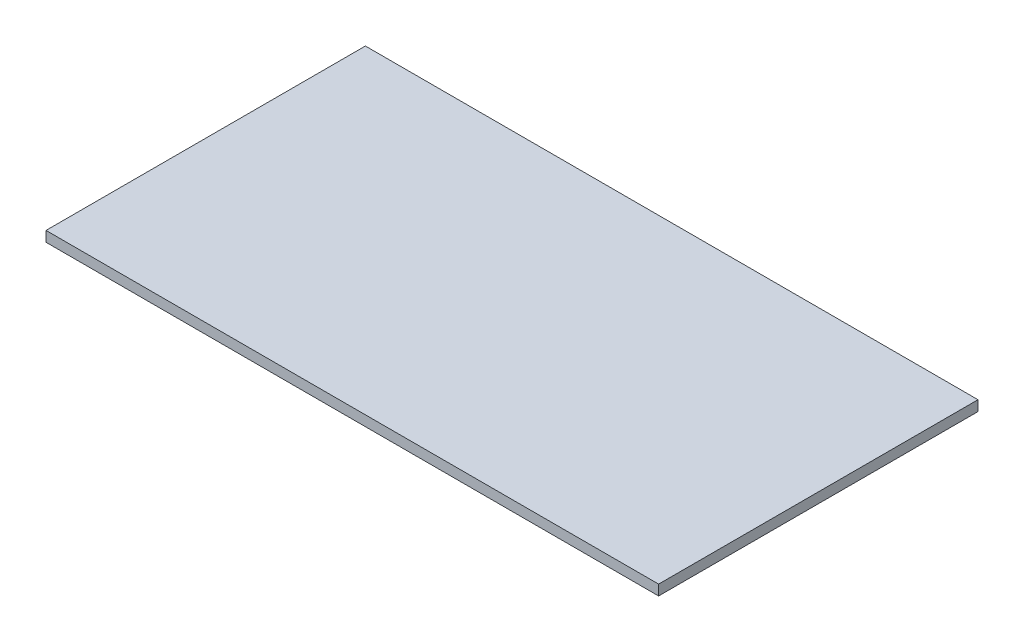
ISO-10303-21;
HEADER;
FILE_DESCRIPTION(('STEP AP214'),'2;1');
FILE_NAME('part.step','',(''),(''),'','','');
FILE_SCHEMA(('AUTOMOTIVE_DESIGN { 1 0 10303 214 1 1 1 1 }'));
ENDSEC;
DATA;
#1=APPLICATION_CONTEXT('core data for automotive mechanical design processes');
#2=APPLICATION_PROTOCOL_DEFINITION('international standard','automotive_design',2000,#1);
#3=PRODUCT_CONTEXT('',#1,'mechanical');
#4=PRODUCT('Part','Part','',(#3));
#5=PRODUCT_RELATED_PRODUCT_CATEGORY('part','',(#4));
#6=PRODUCT_DEFINITION_FORMATION('','',#4);
#7=PRODUCT_DEFINITION_CONTEXT('part definition',#1,'design');
#8=PRODUCT_DEFINITION('design','',#6,#7);
#9=PRODUCT_DEFINITION_SHAPE('','',#8);
#10=(LENGTH_UNIT() NAMED_UNIT(*) SI_UNIT(.MILLI.,.METRE.));
#11=(NAMED_UNIT(*) PLANE_ANGLE_UNIT() SI_UNIT($,.RADIAN.));
#12=(NAMED_UNIT(*) SI_UNIT($,.STERADIAN.) SOLID_ANGLE_UNIT());
#13=UNCERTAINTY_MEASURE_WITH_UNIT(LENGTH_MEASURE(1.E-05),#10,'distance_accuracy_value','');
#14=(GEOMETRIC_REPRESENTATION_CONTEXT(3) GLOBAL_UNCERTAINTY_ASSIGNED_CONTEXT((#13)) GLOBAL_UNIT_ASSIGNED_CONTEXT((#10,
#11,#12)) REPRESENTATION_CONTEXT('',''));
#15=CARTESIAN_POINT('',(0.,0.,0.));
#16=DIRECTION('',(0.,0.,1.));
#17=DIRECTION('',(1.,0.,0.));
#18=AXIS2_PLACEMENT_3D('',#15,#16,#17);
#19=CARTESIAN_POINT('',(63.,0.,31.02));
#20=DIRECTION('',(0.,0.,-1.));
#21=DIRECTION('',(-1.,0.,0.));
#22=AXIS2_PLACEMENT_3D('',#19,#20,#21);
#23=PLANE('',#22);
#24=DIRECTION('',(0.,1.,0.));
#25=VECTOR('',#24,1.);
#26=CARTESIAN_POINT('',(-56.,-8.,31.02));
#27=LINE('',#26,#25);
#28=CARTESIAN_POINT('',(-56.,0.,31.02));
#29=VERTEX_POINT('',#28);
#30=CARTESIAN_POINT('',(-56.,2.,31.02));
#31=VERTEX_POINT('',#30);
#32=EDGE_CURVE('E83',#29,#31,#27,.T.);
#33=ORIENTED_EDGE('',*,*,#32,.F.);
#34=DIRECTION('',(-1.,0.,0.));
#35=VECTOR('',#34,1.);
#36=CARTESIAN_POINT('',(0.,0.,31.02));
#37=LINE('',#36,#35);
#38=CARTESIAN_POINT('',(63.,0.,31.02));
#39=VERTEX_POINT('',#38);
#40=EDGE_CURVE('E92',#39,#29,#37,.T.);
#41=ORIENTED_EDGE('',*,*,#40,.F.);
#42=DIRECTION('',(0.,1.,0.));
#43=VECTOR('',#42,1.);
#44=CARTESIAN_POINT('',(63.,1.,31.02));
#45=LINE('',#44,#43);
#46=CARTESIAN_POINT('',(63.,2.,31.02));
#47=VERTEX_POINT('',#46);
#48=EDGE_CURVE('E86',#39,#47,#45,.T.);
#49=ORIENTED_EDGE('',*,*,#48,.T.);
#50=DIRECTION('',(-1.,0.,0.));
#51=VECTOR('',#50,1.);
#52=CARTESIAN_POINT('',(0.,2.,31.02));
#53=LINE('',#52,#51);
#54=EDGE_CURVE('E72',#47,#31,#53,.T.);
#55=ORIENTED_EDGE('',*,*,#54,.T.);
#56=EDGE_LOOP('',(#33,#41,#49,#55));
#57=FACE_BOUND('',#56,.T.);
#58=ADVANCED_FACE('F34',(#57),#23,.F.);
#59=CARTESIAN_POINT('',(-63.,2.,31.02));
#60=DIRECTION('',(0.,-1.,0.));
#61=DIRECTION('',(0.,0.,-1.));
#62=AXIS2_PLACEMENT_3D('',#59,#60,#61);
#63=PLANE('',#62);
#64=DIRECTION('',(0.,0.,1.));
#65=VECTOR('',#64,1.);
#66=CARTESIAN_POINT('',(-56.,2.,0.));
#67=LINE('',#66,#65);
#68=CARTESIAN_POINT('',(-56.,2.,-31.02));
#69=VERTEX_POINT('',#68);
#70=EDGE_CURVE('E78',#69,#31,#67,.T.);
#71=ORIENTED_EDGE('',*,*,#70,.T.);
#72=ORIENTED_EDGE('',*,*,#54,.F.);
#73=DIRECTION('',(0.,0.,-1.));
#74=VECTOR('',#73,1.);
#75=CARTESIAN_POINT('',(63.,2.,0.));
#76=LINE('',#75,#74);
#77=CARTESIAN_POINT('',(63.,2.,-31.02));
#78=VERTEX_POINT('',#77);
#79=EDGE_CURVE('E76',#47,#78,#76,.T.);
#80=ORIENTED_EDGE('',*,*,#79,.T.);
#81=DIRECTION('',(-1.,0.,0.));
#82=VECTOR('',#81,1.);
#83=CARTESIAN_POINT('',(0.,2.,-31.02));
#84=LINE('',#83,#82);
#85=EDGE_CURVE('E82',#78,#69,#84,.T.);
#86=ORIENTED_EDGE('',*,*,#85,.T.);
#87=EDGE_LOOP('',(#71,#72,#80,#86));
#88=FACE_BOUND('',#87,.T.);
#89=ADVANCED_FACE('F74',(#88),#63,.F.);
#90=CARTESIAN_POINT('',(-63.,0.,-31.02));
#91=DIRECTION('',(0.,0.,1.));
#92=DIRECTION('',(1.,0.,0.));
#93=AXIS2_PLACEMENT_3D('',#90,#91,#92);
#94=PLANE('',#93);
#95=DIRECTION('',(0.,1.,0.));
#96=VECTOR('',#95,1.);
#97=CARTESIAN_POINT('',(-56.,-8.,-31.02));
#98=LINE('',#97,#96);
#99=CARTESIAN_POINT('',(-56.,0.,-31.02));
#100=VERTEX_POINT('',#99);
#101=EDGE_CURVE('E49',#100,#69,#98,.T.);
#102=ORIENTED_EDGE('',*,*,#101,.T.);
#103=ORIENTED_EDGE('',*,*,#85,.F.);
#104=DIRECTION('',(0.,-1.,0.));
#105=VECTOR('',#104,1.);
#106=CARTESIAN_POINT('',(63.,1.,-31.02));
#107=LINE('',#106,#105);
#108=CARTESIAN_POINT('',(63.,0.,-31.02));
#109=VERTEX_POINT('',#108);
#110=EDGE_CURVE('E89',#78,#109,#107,.T.);
#111=ORIENTED_EDGE('',*,*,#110,.T.);
#112=DIRECTION('',(1.,0.,0.));
#113=VECTOR('',#112,1.);
#114=CARTESIAN_POINT('',(0.,0.,-31.02));
#115=LINE('',#114,#113);
#116=EDGE_CURVE('E56',#100,#109,#115,.T.);
#117=ORIENTED_EDGE('',*,*,#116,.F.);
#118=EDGE_LOOP('',(#102,#103,#111,#117));
#119=FACE_BOUND('',#118,.T.);
#120=ADVANCED_FACE('F101',(#119),#94,.F.);
#121=CARTESIAN_POINT('',(-63.,0.,31.02));
#122=DIRECTION('',(0.,-1.,0.));
#123=DIRECTION('',(0.,0.,-1.));
#124=AXIS2_PLACEMENT_3D('',#121,#122,#123);
#125=PLANE('',#124);
#126=ORIENTED_EDGE('',*,*,#40,.T.);
#127=DIRECTION('',(0.,0.,-1.));
#128=VECTOR('',#127,1.);
#129=CARTESIAN_POINT('',(-56.,0.,31.02));
#130=LINE('',#129,#128);
#131=EDGE_CURVE('E11',#29,#100,#130,.T.);
#132=ORIENTED_EDGE('',*,*,#131,.T.);
#133=ORIENTED_EDGE('',*,*,#116,.T.);
#134=DIRECTION('',(0.,0.,1.));
#135=VECTOR('',#134,1.);
#136=CARTESIAN_POINT('',(63.,0.,0.));
#137=LINE('',#136,#135);
#138=EDGE_CURVE('E42',#109,#39,#137,.T.);
#139=ORIENTED_EDGE('',*,*,#138,.T.);
#140=EDGE_LOOP('',(#126,#132,#133,#139));
#141=FACE_BOUND('',#140,.T.);
#142=ADVANCED_FACE('F107',(#141),#125,.T.);
#143=CARTESIAN_POINT('',(63.,0.,-31.02));
#144=DIRECTION('',(-1.,0.,0.));
#145=DIRECTION('',(0.,0.,1.));
#146=AXIS2_PLACEMENT_3D('',#143,#144,#145);
#147=PLANE('',#146);
#148=ORIENTED_EDGE('',*,*,#110,.F.);
#149=ORIENTED_EDGE('',*,*,#79,.F.);
#150=ORIENTED_EDGE('',*,*,#48,.F.);
#151=ORIENTED_EDGE('',*,*,#138,.F.);
#152=EDGE_LOOP('',(#148,#149,#150,#151));
#153=FACE_BOUND('',#152,.T.);
#154=ADVANCED_FACE('F36',(#153),#147,.F.);
#155=CARTESIAN_POINT('',(-56.,-8.,0.));
#156=DIRECTION('',(-1.,0.,0.));
#157=DIRECTION('',(0.,0.,1.));
#158=AXIS2_PLACEMENT_3D('',#155,#156,#157);
#159=PLANE('',#158);
#160=ORIENTED_EDGE('',*,*,#32,.T.);
#161=ORIENTED_EDGE('',*,*,#70,.F.);
#162=ORIENTED_EDGE('',*,*,#101,.F.);
#163=ORIENTED_EDGE('',*,*,#131,.F.);
#164=EDGE_LOOP('',(#160,#161,#162,#163));
#165=FACE_BOUND('',#164,.T.);
#166=ADVANCED_FACE('F108',(#165),#159,.T.);
#167=CLOSED_SHELL('',(#58,#89,#120,#142,#154,#166));
#168=MANIFOLD_SOLID_BREP('B2',#167);
#169=ADVANCED_BREP_SHAPE_REPRESENTATION('',(#18,#168),#14);
#170=SHAPE_DEFINITION_REPRESENTATION(#9,#169);
ENDSEC;
END-ISO-10303-21;
